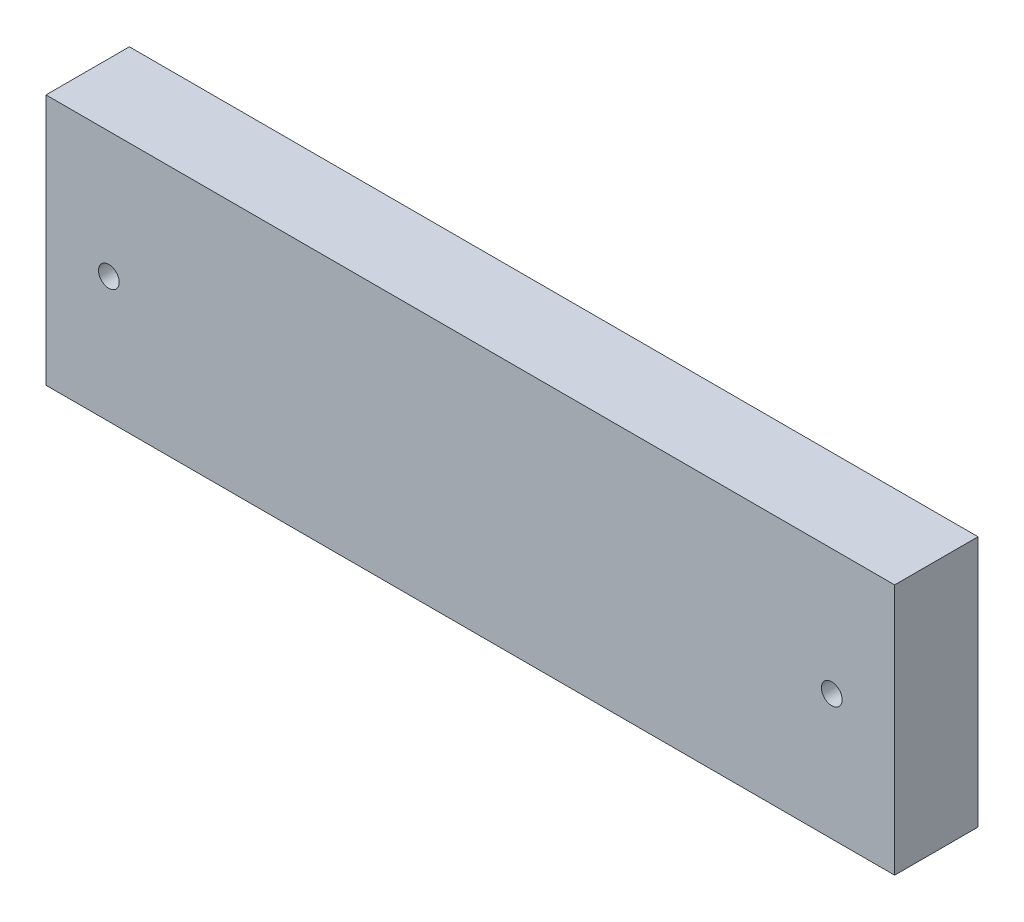
ISO-10303-21;
HEADER;
FILE_DESCRIPTION(('STEP AP214'),'2;1');
FILE_NAME('part.step','',(''),(''),'','','');
FILE_SCHEMA(('AUTOMOTIVE_DESIGN { 1 0 10303 214 1 1 1 1 }'));
ENDSEC;
DATA;
#1=APPLICATION_CONTEXT('core data for automotive mechanical design processes');
#2=APPLICATION_PROTOCOL_DEFINITION('international standard','automotive_design',2000,#1);
#3=PRODUCT_CONTEXT('',#1,'mechanical');
#4=PRODUCT('Part','Part','',(#3));
#5=PRODUCT_RELATED_PRODUCT_CATEGORY('part','',(#4));
#6=PRODUCT_DEFINITION_FORMATION('','',#4);
#7=PRODUCT_DEFINITION_CONTEXT('part definition',#1,'design');
#8=PRODUCT_DEFINITION('design','',#6,#7);
#9=PRODUCT_DEFINITION_SHAPE('','',#8);
#10=(LENGTH_UNIT() NAMED_UNIT(*) SI_UNIT(.MILLI.,.METRE.));
#11=(NAMED_UNIT(*) PLANE_ANGLE_UNIT() SI_UNIT($,.RADIAN.));
#12=(NAMED_UNIT(*) SI_UNIT($,.STERADIAN.) SOLID_ANGLE_UNIT());
#13=UNCERTAINTY_MEASURE_WITH_UNIT(LENGTH_MEASURE(1.E-05),#10,'distance_accuracy_value','');
#14=(GEOMETRIC_REPRESENTATION_CONTEXT(3) GLOBAL_UNCERTAINTY_ASSIGNED_CONTEXT((#13)) GLOBAL_UNIT_ASSIGNED_CONTEXT((#10,
#11,#12)) REPRESENTATION_CONTEXT('',''));
#15=CARTESIAN_POINT('',(0.,0.,0.));
#16=DIRECTION('',(0.,0.,1.));
#17=DIRECTION('',(1.,0.,0.));
#18=AXIS2_PLACEMENT_3D('',#15,#16,#17);
#19=CARTESIAN_POINT('',(67.5,20.,6.63));
#20=DIRECTION('',(-1.,0.,0.));
#21=DIRECTION('',(0.,0.,1.));
#22=AXIS2_PLACEMENT_3D('',#19,#20,#21);
#23=PLANE('',#22);
#24=DIRECTION('',(0.,1.,0.));
#25=VECTOR('',#24,1.);
#26=CARTESIAN_POINT('',(67.5,20.,-6.63));
#27=LINE('',#26,#25);
#28=CARTESIAN_POINT('',(67.5,-20.,-6.63));
#29=VERTEX_POINT('',#28);
#30=CARTESIAN_POINT('',(67.5,20.,-6.63));
#31=VERTEX_POINT('',#30);
#32=EDGE_CURVE('E98',#29,#31,#27,.T.);
#33=ORIENTED_EDGE('',*,*,#32,.T.);
#34=DIRECTION('',(0.,0.,-1.));
#35=VECTOR('',#34,1.);
#36=CARTESIAN_POINT('',(67.5,20.,6.63));
#37=LINE('',#36,#35);
#38=CARTESIAN_POINT('',(67.5,20.,6.63));
#39=VERTEX_POINT('',#38);
#40=EDGE_CURVE('E11',#39,#31,#37,.T.);
#41=ORIENTED_EDGE('',*,*,#40,.F.);
#42=DIRECTION('',(0.,1.,0.));
#43=VECTOR('',#42,1.);
#44=CARTESIAN_POINT('',(67.5,20.,6.63));
#45=LINE('',#44,#43);
#46=CARTESIAN_POINT('',(67.5,-20.,6.63));
#47=VERTEX_POINT('',#46);
#48=EDGE_CURVE('E86',#47,#39,#45,.T.);
#49=ORIENTED_EDGE('',*,*,#48,.F.);
#50=DIRECTION('',(0.,0.,-1.));
#51=VECTOR('',#50,1.);
#52=CARTESIAN_POINT('',(67.5,-20.,6.63));
#53=LINE('',#52,#51);
#54=EDGE_CURVE('E94',#47,#29,#53,.T.);
#55=ORIENTED_EDGE('',*,*,#54,.T.);
#56=EDGE_LOOP('',(#33,#41,#49,#55));
#57=FACE_BOUND('',#56,.T.);
#58=ADVANCED_FACE('F35',(#57),#23,.F.);
#59=CARTESIAN_POINT('',(-67.5,20.,6.63));
#60=DIRECTION('',(0.,-1.,0.));
#61=DIRECTION('',(0.,0.,-1.));
#62=AXIS2_PLACEMENT_3D('',#59,#60,#61);
#63=PLANE('',#62);
#64=DIRECTION('',(-1.,0.,0.));
#65=VECTOR('',#64,1.);
#66=CARTESIAN_POINT('',(-67.5,20.,-6.63));
#67=LINE('',#66,#65);
#68=CARTESIAN_POINT('',(-67.5,20.,-6.63));
#69=VERTEX_POINT('',#68);
#70=EDGE_CURVE('E90',#31,#69,#67,.T.);
#71=ORIENTED_EDGE('',*,*,#70,.T.);
#72=DIRECTION('',(0.,0.,-1.));
#73=VECTOR('',#72,1.);
#74=CARTESIAN_POINT('',(-67.5,20.,6.63));
#75=LINE('',#74,#73);
#76=CARTESIAN_POINT('',(-67.5,20.,6.63));
#77=VERTEX_POINT('',#76);
#78=EDGE_CURVE('E43',#77,#69,#75,.T.);
#79=ORIENTED_EDGE('',*,*,#78,.F.);
#80=DIRECTION('',(-1.,0.,0.));
#81=VECTOR('',#80,1.);
#82=CARTESIAN_POINT('',(-67.5,20.,6.63));
#83=LINE('',#82,#81);
#84=EDGE_CURVE('E81',#39,#77,#83,.T.);
#85=ORIENTED_EDGE('',*,*,#84,.F.);
#86=ORIENTED_EDGE('',*,*,#40,.T.);
#87=EDGE_LOOP('',(#71,#79,#85,#86));
#88=FACE_BOUND('',#87,.T.);
#89=ADVANCED_FACE('F89',(#88),#63,.F.);
#90=CARTESIAN_POINT('',(-67.5,20.,6.63));
#91=DIRECTION('',(1.,0.,0.));
#92=DIRECTION('',(0.,0.,-1.));
#93=AXIS2_PLACEMENT_3D('',#90,#91,#92);
#94=PLANE('',#93);
#95=DIRECTION('',(0.,-1.,0.));
#96=VECTOR('',#95,1.);
#97=CARTESIAN_POINT('',(-67.5,20.,-6.63));
#98=LINE('',#97,#96);
#99=CARTESIAN_POINT('',(-67.5,-20.,-6.63));
#100=VERTEX_POINT('',#99);
#101=EDGE_CURVE('E68',#69,#100,#98,.T.);
#102=ORIENTED_EDGE('',*,*,#101,.T.);
#103=DIRECTION('',(0.,0.,-1.));
#104=VECTOR('',#103,1.);
#105=CARTESIAN_POINT('',(-67.5,-20.,6.63));
#106=LINE('',#105,#104);
#107=CARTESIAN_POINT('',(-67.5,-20.,6.63));
#108=VERTEX_POINT('',#107);
#109=EDGE_CURVE('E91',#108,#100,#106,.T.);
#110=ORIENTED_EDGE('',*,*,#109,.F.);
#111=DIRECTION('',(0.,-1.,0.));
#112=VECTOR('',#111,1.);
#113=CARTESIAN_POINT('',(-67.5,20.,6.63));
#114=LINE('',#113,#112);
#115=EDGE_CURVE('E84',#77,#108,#114,.T.);
#116=ORIENTED_EDGE('',*,*,#115,.F.);
#117=ORIENTED_EDGE('',*,*,#78,.T.);
#118=EDGE_LOOP('',(#102,#110,#116,#117));
#119=FACE_BOUND('',#118,.T.);
#120=ADVANCED_FACE('F92',(#119),#94,.F.);
#121=CARTESIAN_POINT('',(-67.5,-20.,6.63));
#122=DIRECTION('',(0.,1.,0.));
#123=DIRECTION('',(0.,0.,1.));
#124=AXIS2_PLACEMENT_3D('',#121,#122,#123);
#125=PLANE('',#124);
#126=DIRECTION('',(1.,0.,0.));
#127=VECTOR('',#126,1.);
#128=CARTESIAN_POINT('',(-67.5,-20.,-6.63));
#129=LINE('',#128,#127);
#130=EDGE_CURVE('E74',#100,#29,#129,.T.);
#131=ORIENTED_EDGE('',*,*,#130,.T.);
#132=ORIENTED_EDGE('',*,*,#54,.F.);
#133=DIRECTION('',(1.,0.,0.));
#134=VECTOR('',#133,1.);
#135=CARTESIAN_POINT('',(-67.5,-20.,6.63));
#136=LINE('',#135,#134);
#137=EDGE_CURVE('E51',#108,#47,#136,.T.);
#138=ORIENTED_EDGE('',*,*,#137,.F.);
#139=ORIENTED_EDGE('',*,*,#109,.T.);
#140=EDGE_LOOP('',(#131,#132,#138,#139));
#141=FACE_BOUND('',#140,.T.);
#142=ADVANCED_FACE('F106',(#141),#125,.F.);
#143=CARTESIAN_POINT('',(0.,0.,6.63));
#144=DIRECTION('',(0.,0.,1.));
#145=DIRECTION('',(1.,0.,0.));
#146=AXIS2_PLACEMENT_3D('',#143,#144,#145);
#147=PLANE('',#146);
#148=CARTESIAN_POINT('',(57.5,0.,6.63));
#149=DIRECTION('',(0.,0.,1.));
#150=DIRECTION('',(1.,0.,0.));
#151=AXIS2_PLACEMENT_3D('',#148,#149,#150);
#152=CIRCLE('',#151,1.65);
#153=CARTESIAN_POINT('',(59.15,0.,6.63));
#154=VERTEX_POINT('',#153);
#155=EDGE_CURVE('E120',#154,#154,#152,.T.);
#156=ORIENTED_EDGE('',*,*,#155,.F.);
#157=EDGE_LOOP('',(#156));
#158=FACE_BOUND('',#157,.T.);
#159=CARTESIAN_POINT('',(-57.5,0.,6.63));
#160=DIRECTION('',(0.,0.,1.));
#161=DIRECTION('',(1.,0.,0.));
#162=AXIS2_PLACEMENT_3D('',#159,#160,#161);
#163=CIRCLE('',#162,1.65);
#164=CARTESIAN_POINT('',(-55.85,0.,6.63));
#165=VERTEX_POINT('',#164);
#166=EDGE_CURVE('E114',#165,#165,#163,.T.);
#167=ORIENTED_EDGE('',*,*,#166,.F.);
#168=EDGE_LOOP('',(#167));
#169=FACE_BOUND('',#168,.T.);
#170=ORIENTED_EDGE('',*,*,#48,.T.);
#171=ORIENTED_EDGE('',*,*,#84,.T.);
#172=ORIENTED_EDGE('',*,*,#115,.T.);
#173=ORIENTED_EDGE('',*,*,#137,.T.);
#174=EDGE_LOOP('',(#170,#171,#172,#173));
#175=FACE_BOUND('',#174,.T.);
#176=ADVANCED_FACE('F82',(#158,#169,#175),#147,.T.);
#177=CARTESIAN_POINT('',(0.,0.,-6.63));
#178=DIRECTION('',(0.,0.,1.));
#179=DIRECTION('',(1.,0.,0.));
#180=AXIS2_PLACEMENT_3D('',#177,#178,#179);
#181=PLANE('',#180);
#182=CARTESIAN_POINT('',(57.5,0.,-6.63));
#183=DIRECTION('',(0.,0.,1.));
#184=DIRECTION('',(1.,0.,0.));
#185=AXIS2_PLACEMENT_3D('',#182,#183,#184);
#186=CIRCLE('',#185,1.65);
#187=CARTESIAN_POINT('',(59.15,0.,-6.63));
#188=VERTEX_POINT('',#187);
#189=EDGE_CURVE('E117',#188,#188,#186,.T.);
#190=ORIENTED_EDGE('',*,*,#189,.T.);
#191=EDGE_LOOP('',(#190));
#192=FACE_BOUND('',#191,.T.);
#193=CARTESIAN_POINT('',(-57.5,0.,-6.63));
#194=DIRECTION('',(0.,0.,1.));
#195=DIRECTION('',(1.,0.,0.));
#196=AXIS2_PLACEMENT_3D('',#193,#194,#195);
#197=CIRCLE('',#196,1.65);
#198=CARTESIAN_POINT('',(-55.85,0.,-6.63));
#199=VERTEX_POINT('',#198);
#200=EDGE_CURVE('E101',#199,#199,#197,.T.);
#201=ORIENTED_EDGE('',*,*,#200,.T.);
#202=EDGE_LOOP('',(#201));
#203=FACE_BOUND('',#202,.T.);
#204=ORIENTED_EDGE('',*,*,#32,.F.);
#205=ORIENTED_EDGE('',*,*,#130,.F.);
#206=ORIENTED_EDGE('',*,*,#101,.F.);
#207=ORIENTED_EDGE('',*,*,#70,.F.);
#208=EDGE_LOOP('',(#204,#205,#206,#207));
#209=FACE_BOUND('',#208,.T.);
#210=ADVANCED_FACE('F109',(#192,#203,#209),#181,.F.);
#211=CARTESIAN_POINT('',(-57.5,0.,6.63));
#212=DIRECTION('',(0.,0.,1.));
#213=DIRECTION('',(1.,0.,0.));
#214=AXIS2_PLACEMENT_3D('',#211,#212,#213);
#215=CYLINDRICAL_SURFACE('',#214,1.65);
#216=ORIENTED_EDGE('',*,*,#200,.F.);
#217=EDGE_LOOP('',(#216));
#218=FACE_BOUND('',#217,.T.);
#219=ORIENTED_EDGE('',*,*,#166,.T.);
#220=EDGE_LOOP('',(#219));
#221=FACE_BOUND('',#220,.T.);
#222=ADVANCED_FACE('F131',(#218,#221),#215,.F.);
#223=CARTESIAN_POINT('',(57.5,0.,6.63));
#224=DIRECTION('',(0.,0.,1.));
#225=DIRECTION('',(1.,0.,0.));
#226=AXIS2_PLACEMENT_3D('',#223,#224,#225);
#227=CYLINDRICAL_SURFACE('',#226,1.65);
#228=ORIENTED_EDGE('',*,*,#189,.F.);
#229=EDGE_LOOP('',(#228));
#230=FACE_BOUND('',#229,.T.);
#231=ORIENTED_EDGE('',*,*,#155,.T.);
#232=EDGE_LOOP('',(#231));
#233=FACE_BOUND('',#232,.T.);
#234=ADVANCED_FACE('F124',(#230,#233),#227,.F.);
#235=CLOSED_SHELL('',(#58,#89,#120,#142,#176,#210,#222,#234));
#236=MANIFOLD_SOLID_BREP('B2',#235);
#237=ADVANCED_BREP_SHAPE_REPRESENTATION('',(#18,#236),#14);
#238=SHAPE_DEFINITION_REPRESENTATION(#9,#237);
ENDSEC;
END-ISO-10303-21;
